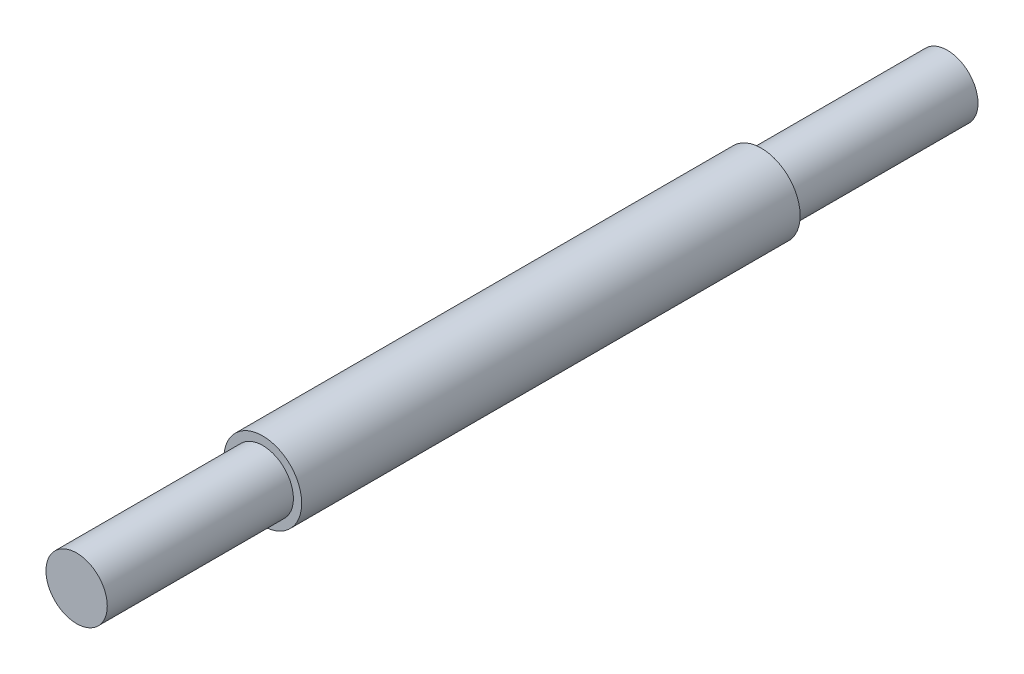
ISO-10303-21;
HEADER;
FILE_DESCRIPTION(('STEP AP214'),'2;1');
FILE_NAME('part.step','',(''),(''),'','','');
FILE_SCHEMA(('AUTOMOTIVE_DESIGN { 1 0 10303 214 1 1 1 1 }'));
ENDSEC;
DATA;
#1=APPLICATION_CONTEXT('core data for automotive mechanical design processes');
#2=APPLICATION_PROTOCOL_DEFINITION('international standard','automotive_design',2000,#1);
#3=PRODUCT_CONTEXT('',#1,'mechanical');
#4=PRODUCT('Part','Part','',(#3));
#5=PRODUCT_RELATED_PRODUCT_CATEGORY('part','',(#4));
#6=PRODUCT_DEFINITION_FORMATION('','',#4);
#7=PRODUCT_DEFINITION_CONTEXT('part definition',#1,'design');
#8=PRODUCT_DEFINITION('design','',#6,#7);
#9=PRODUCT_DEFINITION_SHAPE('','',#8);
#10=(LENGTH_UNIT() NAMED_UNIT(*) SI_UNIT(.MILLI.,.METRE.));
#11=(NAMED_UNIT(*) PLANE_ANGLE_UNIT() SI_UNIT($,.RADIAN.));
#12=(NAMED_UNIT(*) SI_UNIT($,.STERADIAN.) SOLID_ANGLE_UNIT());
#13=UNCERTAINTY_MEASURE_WITH_UNIT(LENGTH_MEASURE(1.E-05),#10,'distance_accuracy_value','');
#14=(GEOMETRIC_REPRESENTATION_CONTEXT(3) GLOBAL_UNCERTAINTY_ASSIGNED_CONTEXT((#13)) GLOBAL_UNIT_ASSIGNED_CONTEXT((#10,
#11,#12)) REPRESENTATION_CONTEXT('',''));
#15=CARTESIAN_POINT('',(0.,0.,0.));
#16=DIRECTION('',(0.,0.,1.));
#17=DIRECTION('',(1.,0.,0.));
#18=AXIS2_PLACEMENT_3D('',#15,#16,#17);
#19=CARTESIAN_POINT('',(0.,0.,-35.494976));
#20=DIRECTION('',(0.,0.,1.));
#21=DIRECTION('',(1.,0.,0.));
#22=AXIS2_PLACEMENT_3D('',#19,#20,#21);
#23=CYLINDRICAL_SURFACE('',#22,2.5);
#24=CARTESIAN_POINT('',(0.,0.,-35.494976));
#25=DIRECTION('',(0.,0.,1.));
#26=DIRECTION('',(1.,0.,0.));
#27=AXIS2_PLACEMENT_3D('',#24,#25,#26);
#28=CIRCLE('',#27,2.5);
#29=CARTESIAN_POINT('',(2.5,0.,-35.494976));
#30=VERTEX_POINT('',#29);
#31=EDGE_CURVE('E45',#30,#30,#28,.T.);
#32=ORIENTED_EDGE('',*,*,#31,.T.);
#33=EDGE_LOOP('',(#32));
#34=FACE_BOUND('',#33,.T.);
#35=CARTESIAN_POINT('',(0.,0.,-20.32));
#36=DIRECTION('',(0.,0.,1.));
#37=DIRECTION('',(1.,0.,0.));
#38=AXIS2_PLACEMENT_3D('',#35,#36,#37);
#39=CIRCLE('',#38,2.5);
#40=CARTESIAN_POINT('',(2.5,0.,-20.32));
#41=VERTEX_POINT('',#40);
#42=EDGE_CURVE('E41',#41,#41,#39,.F.);
#43=ORIENTED_EDGE('',*,*,#42,.T.);
#44=EDGE_LOOP('',(#43));
#45=FACE_BOUND('',#44,.T.);
#46=ADVANCED_FACE('F37',(#34,#45),#23,.T.);
#47=CARTESIAN_POINT('',(0.,0.,-35.494976));
#48=DIRECTION('',(0.,0.,1.));
#49=DIRECTION('',(1.,0.,0.));
#50=AXIS2_PLACEMENT_3D('',#47,#48,#49);
#51=PLANE('',#50);
#52=ORIENTED_EDGE('',*,*,#31,.F.);
#53=EDGE_LOOP('',(#52));
#54=FACE_BOUND('',#53,.T.);
#55=ADVANCED_FACE('F66',(#54),#51,.F.);
#56=CARTESIAN_POINT('',(0.,0.,-20.32));
#57=DIRECTION('',(0.,0.,1.));
#58=DIRECTION('',(1.,0.,0.));
#59=AXIS2_PLACEMENT_3D('',#56,#57,#58);
#60=CYLINDRICAL_SURFACE('',#59,3.175);
#61=CARTESIAN_POINT('',(0.,0.,-20.32));
#62=DIRECTION('',(0.,0.,1.));
#63=DIRECTION('',(1.,0.,0.));
#64=AXIS2_PLACEMENT_3D('',#61,#62,#63);
#65=CIRCLE('',#64,3.175);
#66=CARTESIAN_POINT('',(3.175,0.,-20.32));
#67=VERTEX_POINT('',#66);
#68=EDGE_CURVE('E54',#67,#67,#65,.T.);
#69=ORIENTED_EDGE('',*,*,#68,.T.);
#70=EDGE_LOOP('',(#69));
#71=FACE_BOUND('',#70,.T.);
#72=CARTESIAN_POINT('',(0.,0.,20.32));
#73=DIRECTION('',(0.,0.,1.));
#74=DIRECTION('',(1.,0.,0.));
#75=AXIS2_PLACEMENT_3D('',#72,#73,#74);
#76=CIRCLE('',#75,3.175);
#77=CARTESIAN_POINT('',(3.175,0.,20.32));
#78=VERTEX_POINT('',#77);
#79=EDGE_CURVE('E57',#78,#78,#76,.T.);
#80=ORIENTED_EDGE('',*,*,#79,.F.);
#81=EDGE_LOOP('',(#80));
#82=FACE_BOUND('',#81,.T.);
#83=ADVANCED_FACE('F63',(#71,#82),#60,.T.);
#84=CARTESIAN_POINT('',(0.,0.,-20.32));
#85=DIRECTION('',(0.,0.,1.));
#86=DIRECTION('',(1.,0.,0.));
#87=AXIS2_PLACEMENT_3D('',#84,#85,#86);
#88=PLANE('',#87);
#89=ORIENTED_EDGE('',*,*,#42,.F.);
#90=EDGE_LOOP('',(#89));
#91=FACE_BOUND('',#90,.T.);
#92=ORIENTED_EDGE('',*,*,#68,.F.);
#93=EDGE_LOOP('',(#92));
#94=FACE_BOUND('',#93,.T.);
#95=ADVANCED_FACE('F65',(#91,#94),#88,.F.);
#96=CARTESIAN_POINT('',(0.,0.,20.32));
#97=DIRECTION('',(0.,0.,1.));
#98=DIRECTION('',(1.,0.,0.));
#99=AXIS2_PLACEMENT_3D('',#96,#97,#98);
#100=PLANE('',#99);
#101=CARTESIAN_POINT('',(0.,0.,20.32));
#102=DIRECTION('',(0.,0.,1.));
#103=DIRECTION('',(1.,0.,0.));
#104=AXIS2_PLACEMENT_3D('',#101,#102,#103);
#105=CIRCLE('',#104,2.5);
#106=CARTESIAN_POINT('',(2.5,0.,20.32));
#107=VERTEX_POINT('',#106);
#108=EDGE_CURVE('E10',#107,#107,#105,.F.);
#109=ORIENTED_EDGE('',*,*,#108,.T.);
#110=EDGE_LOOP('',(#109));
#111=FACE_BOUND('',#110,.T.);
#112=ORIENTED_EDGE('',*,*,#79,.T.);
#113=EDGE_LOOP('',(#112));
#114=FACE_BOUND('',#113,.T.);
#115=ADVANCED_FACE('F61',(#111,#114),#100,.T.);
#116=CARTESIAN_POINT('',(0.,0.,35.494976));
#117=DIRECTION('',(0.,0.,1.));
#118=DIRECTION('',(1.,0.,0.));
#119=AXIS2_PLACEMENT_3D('',#116,#117,#118);
#120=PLANE('',#119);
#121=CARTESIAN_POINT('',(0.,0.,35.494976));
#122=DIRECTION('',(0.,0.,1.));
#123=DIRECTION('',(1.,0.,0.));
#124=AXIS2_PLACEMENT_3D('',#121,#122,#123);
#125=CIRCLE('',#124,2.5);
#126=CARTESIAN_POINT('',(2.5,0.,35.494976));
#127=VERTEX_POINT('',#126);
#128=EDGE_CURVE('E49',#127,#127,#125,.T.);
#129=ORIENTED_EDGE('',*,*,#128,.T.);
#130=EDGE_LOOP('',(#129));
#131=FACE_BOUND('',#130,.T.);
#132=ADVANCED_FACE('F83',(#131),#120,.T.);
#133=ORIENTED_EDGE('',*,*,#108,.F.);
#134=EDGE_LOOP('',(#133));
#135=FACE_BOUND('',#134,.T.);
#136=ORIENTED_EDGE('',*,*,#128,.F.);
#137=EDGE_LOOP('',(#136));
#138=FACE_BOUND('',#137,.T.);
#139=ADVANCED_FACE('F39',(#135,#138),#23,.T.);
#140=CLOSED_SHELL('',(#46,#55,#83,#95,#115,#132,#139));
#141=MANIFOLD_SOLID_BREP('B2',#140);
#142=ADVANCED_BREP_SHAPE_REPRESENTATION('',(#18,#141),#14);
#143=SHAPE_DEFINITION_REPRESENTATION(#9,#142);
ENDSEC;
END-ISO-10303-21;
